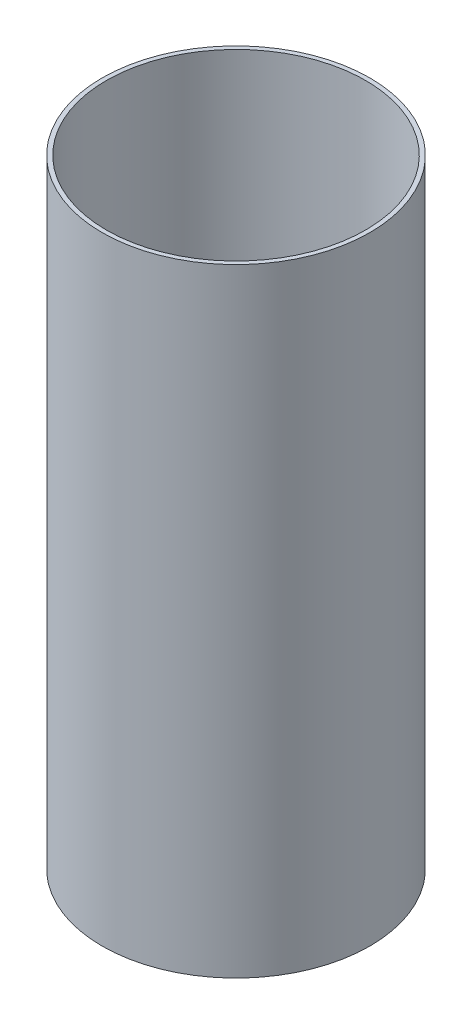
ISO-10303-21;
HEADER;
FILE_DESCRIPTION(('STEP AP214'),'2;1');
FILE_NAME('part.step','',(''),(''),'','','');
FILE_SCHEMA(('AUTOMOTIVE_DESIGN { 1 0 10303 214 1 1 1 1 }'));
ENDSEC;
DATA;
#1=APPLICATION_CONTEXT('core data for automotive mechanical design processes');
#2=APPLICATION_PROTOCOL_DEFINITION('international standard','automotive_design',2000,#1);
#3=PRODUCT_CONTEXT('',#1,'mechanical');
#4=PRODUCT('Part','Part','',(#3));
#5=PRODUCT_RELATED_PRODUCT_CATEGORY('part','',(#4));
#6=PRODUCT_DEFINITION_FORMATION('','',#4);
#7=PRODUCT_DEFINITION_CONTEXT('part definition',#1,'design');
#8=PRODUCT_DEFINITION('design','',#6,#7);
#9=PRODUCT_DEFINITION_SHAPE('','',#8);
#10=(LENGTH_UNIT() NAMED_UNIT(*) SI_UNIT(.MILLI.,.METRE.));
#11=(NAMED_UNIT(*) PLANE_ANGLE_UNIT() SI_UNIT($,.RADIAN.));
#12=(NAMED_UNIT(*) SI_UNIT($,.STERADIAN.) SOLID_ANGLE_UNIT());
#13=UNCERTAINTY_MEASURE_WITH_UNIT(LENGTH_MEASURE(1.E-05),#10,'distance_accuracy_value','');
#14=(GEOMETRIC_REPRESENTATION_CONTEXT(3) GLOBAL_UNCERTAINTY_ASSIGNED_CONTEXT((#13)) GLOBAL_UNIT_ASSIGNED_CONTEXT((#10,
#11,#12)) REPRESENTATION_CONTEXT('',''));
#15=CARTESIAN_POINT('',(0.,0.,0.));
#16=DIRECTION('',(0.,0.,1.));
#17=DIRECTION('',(1.,0.,0.));
#18=AXIS2_PLACEMENT_3D('',#15,#16,#17);
#19=CARTESIAN_POINT('',(0.,228.6,0.));
#20=DIRECTION('',(0.,1.,0.));
#21=DIRECTION('',(0.,0.,1.));
#22=AXIS2_PLACEMENT_3D('',#19,#20,#21);
#23=PLANE('',#22);
#24=CARTESIAN_POINT('',(0.,228.6,0.));
#25=DIRECTION('',(0.,1.,0.));
#26=DIRECTION('',(0.,0.,1.));
#27=AXIS2_PLACEMENT_3D('',#24,#25,#26);
#28=CIRCLE('',#27,49.55);
#29=CARTESIAN_POINT('',(0.,228.6,49.55));
#30=VERTEX_POINT('',#29);
#31=EDGE_CURVE('E10',#30,#30,#28,.T.);
#32=ORIENTED_EDGE('',*,*,#31,.T.);
#33=EDGE_LOOP('',(#32));
#34=FACE_BOUND('',#33,.T.);
#35=CARTESIAN_POINT('',(0.,228.6,0.));
#36=DIRECTION('',(0.,1.,0.));
#37=DIRECTION('',(0.,0.,1.));
#38=AXIS2_PLACEMENT_3D('',#35,#36,#37);
#39=CIRCLE('',#38,47.95);
#40=CARTESIAN_POINT('',(0.,228.6,47.95));
#41=VERTEX_POINT('',#40);
#42=EDGE_CURVE('E42',#41,#41,#39,.T.);
#43=ORIENTED_EDGE('',*,*,#42,.F.);
#44=EDGE_LOOP('',(#43));
#45=FACE_BOUND('',#44,.T.);
#46=ADVANCED_FACE('F31',(#34,#45),#23,.T.);
#47=CARTESIAN_POINT('',(0.,0.,0.));
#48=DIRECTION('',(0.,1.,0.));
#49=DIRECTION('',(0.,0.,1.));
#50=AXIS2_PLACEMENT_3D('',#47,#48,#49);
#51=PLANE('',#50);
#52=CARTESIAN_POINT('',(0.,0.,0.));
#53=DIRECTION('',(0.,1.,0.));
#54=DIRECTION('',(0.,0.,1.));
#55=AXIS2_PLACEMENT_3D('',#52,#53,#54);
#56=CIRCLE('',#55,49.55);
#57=CARTESIAN_POINT('',(0.,0.,49.55));
#58=VERTEX_POINT('',#57);
#59=EDGE_CURVE('E35',#58,#58,#56,.T.);
#60=ORIENTED_EDGE('',*,*,#59,.F.);
#61=EDGE_LOOP('',(#60));
#62=FACE_BOUND('',#61,.T.);
#63=CARTESIAN_POINT('',(0.,0.,0.));
#64=DIRECTION('',(0.,1.,0.));
#65=DIRECTION('',(0.,0.,1.));
#66=AXIS2_PLACEMENT_3D('',#63,#64,#65);
#67=CIRCLE('',#66,47.95);
#68=CARTESIAN_POINT('',(0.,0.,47.95));
#69=VERTEX_POINT('',#68);
#70=EDGE_CURVE('E44',#69,#69,#67,.T.);
#71=ORIENTED_EDGE('',*,*,#70,.T.);
#72=EDGE_LOOP('',(#71));
#73=FACE_BOUND('',#72,.T.);
#74=ADVANCED_FACE('F54',(#62,#73),#51,.F.);
#75=CARTESIAN_POINT('',(0.,228.6,0.));
#76=DIRECTION('',(0.,-1.,0.));
#77=DIRECTION('',(0.,0.,-1.));
#78=AXIS2_PLACEMENT_3D('',#75,#76,#77);
#79=CYLINDRICAL_SURFACE('',#78,49.55);
#80=ORIENTED_EDGE('',*,*,#31,.F.);
#81=EDGE_LOOP('',(#80));
#82=FACE_BOUND('',#81,.T.);
#83=ORIENTED_EDGE('',*,*,#59,.T.);
#84=EDGE_LOOP('',(#83));
#85=FACE_BOUND('',#84,.T.);
#86=ADVANCED_FACE('F33',(#82,#85),#79,.T.);
#87=CARTESIAN_POINT('',(0.,228.6,0.));
#88=DIRECTION('',(0.,-1.,0.));
#89=DIRECTION('',(0.,0.,-1.));
#90=AXIS2_PLACEMENT_3D('',#87,#88,#89);
#91=CYLINDRICAL_SURFACE('',#90,47.95);
#92=ORIENTED_EDGE('',*,*,#42,.T.);
#93=EDGE_LOOP('',(#92));
#94=FACE_BOUND('',#93,.T.);
#95=ORIENTED_EDGE('',*,*,#70,.F.);
#96=EDGE_LOOP('',(#95));
#97=FACE_BOUND('',#96,.T.);
#98=ADVANCED_FACE('F50',(#94,#97),#91,.F.);
#99=CLOSED_SHELL('',(#46,#74,#86,#98));
#100=MANIFOLD_SOLID_BREP('B2',#99);
#101=ADVANCED_BREP_SHAPE_REPRESENTATION('',(#18,#100),#14);
#102=SHAPE_DEFINITION_REPRESENTATION(#9,#101);
ENDSEC;
END-ISO-10303-21;
